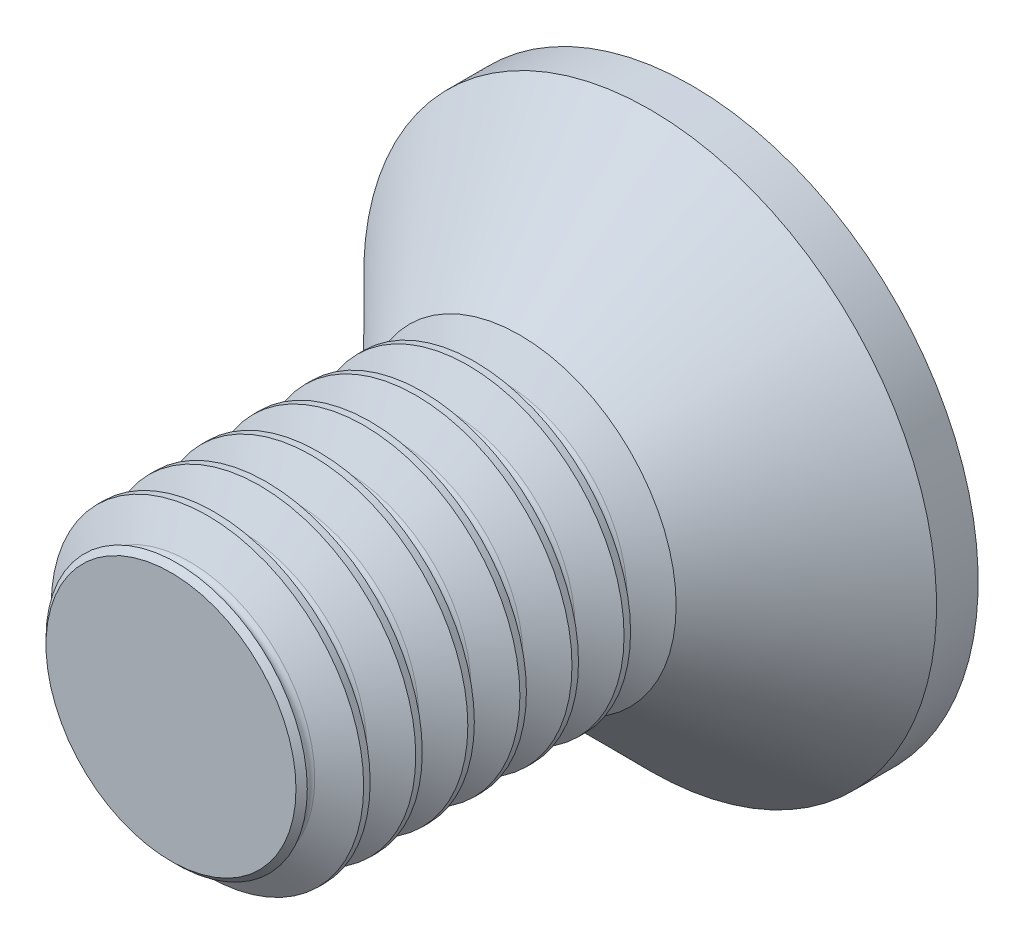
ISO-10303-21;
HEADER;
FILE_DESCRIPTION(('STEP AP214'),'2;1');
FILE_NAME('part.step','',(''),(''),'','','');
FILE_SCHEMA(('AUTOMOTIVE_DESIGN { 1 0 10303 214 1 1 1 1 }'));
ENDSEC;
DATA;
#1=APPLICATION_CONTEXT('core data for automotive mechanical design processes');
#2=APPLICATION_PROTOCOL_DEFINITION('international standard','automotive_design',2000,#1);
#3=PRODUCT_CONTEXT('',#1,'mechanical');
#4=PRODUCT('Part','Part','',(#3));
#5=PRODUCT_RELATED_PRODUCT_CATEGORY('part','',(#4));
#6=PRODUCT_DEFINITION_FORMATION('','',#4);
#7=PRODUCT_DEFINITION_CONTEXT('part definition',#1,'design');
#8=PRODUCT_DEFINITION('design','',#6,#7);
#9=PRODUCT_DEFINITION_SHAPE('','',#8);
#10=(LENGTH_UNIT() NAMED_UNIT(*) SI_UNIT(.MILLI.,.METRE.));
#11=(NAMED_UNIT(*) PLANE_ANGLE_UNIT() SI_UNIT($,.RADIAN.));
#12=(NAMED_UNIT(*) SI_UNIT($,.STERADIAN.) SOLID_ANGLE_UNIT());
#13=UNCERTAINTY_MEASURE_WITH_UNIT(LENGTH_MEASURE(1.E-05),#10,'distance_accuracy_value','');
#14=(GEOMETRIC_REPRESENTATION_CONTEXT(3) GLOBAL_UNCERTAINTY_ASSIGNED_CONTEXT((#13)) GLOBAL_UNIT_ASSIGNED_CONTEXT((#10,
#11,#12)) REPRESENTATION_CONTEXT('',''));
#15=CARTESIAN_POINT('',(0.,0.,0.));
#16=DIRECTION('',(0.,0.,1.));
#17=DIRECTION('',(1.,0.,0.));
#18=AXIS2_PLACEMENT_3D('',#15,#16,#17);
#19=CARTESIAN_POINT('',(0.,1.5,0.));
#20=DIRECTION('',(0.,0.,1.));
#21=DIRECTION('',(1.,0.,0.));
#22=AXIS2_PLACEMENT_3D('',#19,#20,#21);
#23=PLANE('',#22);
#24=CARTESIAN_POINT('',(0.,0.,0.));
#25=DIRECTION('',(0.,0.,-1.));
#26=DIRECTION('',(0.,1.,0.));
#27=AXIS2_PLACEMENT_3D('',#24,#25,#26);
#28=CIRCLE('',#27,2.75);
#29=CARTESIAN_POINT('',(0.,2.75,0.));
#30=VERTEX_POINT('',#29);
#31=EDGE_CURVE('E210',#30,#30,#28,.T.);
#32=ORIENTED_EDGE('',*,*,#31,.T.);
#33=EDGE_LOOP('',(#32));
#34=FACE_BOUND('',#33,.T.);
#35=CARTESIAN_POINT('',(0.808290376865476,1.4,0.));
#36=DIRECTION('',(0.,0.,-1.));
#37=DIRECTION('',(1.,0.,0.));
#38=AXIS2_PLACEMENT_3D('',#35,#36,#37);
#39=CIRCLE('',#38,0.642202852251812);
#40=CARTESIAN_POINT('',(0.995362839029657,0.785647985809281,0.));
#41=VERTEX_POINT('',#40);
#42=CARTESIAN_POINT('',(0.182709694628085,1.25483349748732,0.));
#43=VERTEX_POINT('',#42);
#44=EDGE_CURVE('E53',#41,#43,#39,.T.);
#45=ORIENTED_EDGE('',*,*,#44,.T.);
#46=CARTESIAN_POINT('',(0.,1.21243556529821,0.));
#47=DIRECTION('',(0.,0.,1.));
#48=DIRECTION('',(1.,0.,0.));
#49=AXIS2_PLACEMENT_3D('',#46,#47,#48);
#50=CIRCLE('',#49,0.187564434701786);
#51=CARTESIAN_POINT('',(-0.182709694628085,1.25483349748732,0.));
#52=VERTEX_POINT('',#51);
#53=EDGE_CURVE('E183',#43,#52,#50,.T.);
#54=ORIENTED_EDGE('',*,*,#53,.T.);
#55=CARTESIAN_POINT('',(-0.808290376865476,1.4,0.));
#56=DIRECTION('',(0.,0.,-1.));
#57=DIRECTION('',(1.,0.,0.));
#58=AXIS2_PLACEMENT_3D('',#55,#56,#57);
#59=CIRCLE('',#58,0.642202852251812);
#60=CARTESIAN_POINT('',(-0.995362839029657,0.785647985809281,0.));
#61=VERTEX_POINT('',#60);
#62=EDGE_CURVE('E186',#52,#61,#59,.T.);
#63=ORIENTED_EDGE('',*,*,#62,.T.);
#64=CARTESIAN_POINT('',(-1.05,0.606217782649107,0.));
#65=DIRECTION('',(0.,0.,1.));
#66=DIRECTION('',(1.,0.,0.));
#67=AXIS2_PLACEMENT_3D('',#64,#65,#66);
#68=CIRCLE('',#67,0.187564434701786);
#69=CARTESIAN_POINT('',(-1.17807253365774,0.469185511678043,0.));
#70=VERTEX_POINT('',#69);
#71=EDGE_CURVE('E189',#61,#70,#68,.T.);
#72=ORIENTED_EDGE('',*,*,#71,.T.);
#73=CARTESIAN_POINT('',(-1.61658075373095,0.,0.));
#74=DIRECTION('',(0.,0.,-1.));
#75=DIRECTION('',(1.,0.,0.));
#76=AXIS2_PLACEMENT_3D('',#73,#74,#75);
#77=CIRCLE('',#76,0.642202852251811);
#78=CARTESIAN_POINT('',(-1.17807253365774,-0.469185511678043,0.));
#79=VERTEX_POINT('',#78);
#80=EDGE_CURVE('E192',#70,#79,#77,.T.);
#81=ORIENTED_EDGE('',*,*,#80,.T.);
#82=CARTESIAN_POINT('',(-1.05,-0.606217782649107,0.));
#83=DIRECTION('',(0.,0.,1.));
#84=DIRECTION('',(1.,0.,0.));
#85=AXIS2_PLACEMENT_3D('',#82,#83,#84);
#86=CIRCLE('',#85,0.187564434701786);
#87=CARTESIAN_POINT('',(-0.995362839029657,-0.785647985809281,0.));
#88=VERTEX_POINT('',#87);
#89=EDGE_CURVE('E195',#79,#88,#86,.T.);
#90=ORIENTED_EDGE('',*,*,#89,.T.);
#91=CARTESIAN_POINT('',(-0.808290376865476,-1.4,0.));
#92=DIRECTION('',(0.,0.,-1.));
#93=DIRECTION('',(1.,0.,0.));
#94=AXIS2_PLACEMENT_3D('',#91,#92,#93);
#95=CIRCLE('',#94,0.642202852251812);
#96=CARTESIAN_POINT('',(-0.182709694628085,-1.25483349748732,0.));
#97=VERTEX_POINT('',#96);
#98=EDGE_CURVE('E198',#88,#97,#95,.T.);
#99=ORIENTED_EDGE('',*,*,#98,.T.);
#100=CARTESIAN_POINT('',(0.,-1.21243556529821,0.));
#101=DIRECTION('',(0.,0.,1.));
#102=DIRECTION('',(1.,0.,0.));
#103=AXIS2_PLACEMENT_3D('',#100,#101,#102);
#104=CIRCLE('',#103,0.187564434701786);
#105=CARTESIAN_POINT('',(0.182709694628085,-1.25483349748732,0.));
#106=VERTEX_POINT('',#105);
#107=EDGE_CURVE('E201',#97,#106,#104,.T.);
#108=ORIENTED_EDGE('',*,*,#107,.T.);
#109=CARTESIAN_POINT('',(0.808290376865476,-1.4,0.));
#110=DIRECTION('',(0.,0.,-1.));
#111=DIRECTION('',(1.,0.,0.));
#112=AXIS2_PLACEMENT_3D('',#109,#110,#111);
#113=CIRCLE('',#112,0.642202852251812);
#114=CARTESIAN_POINT('',(0.995362839029657,-0.78564798580928,0.));
#115=VERTEX_POINT('',#114);
#116=EDGE_CURVE('E204',#106,#115,#113,.T.);
#117=ORIENTED_EDGE('',*,*,#116,.T.);
#118=CARTESIAN_POINT('',(1.05,-0.606217782649106,0.));
#119=DIRECTION('',(0.,0.,1.));
#120=DIRECTION('',(1.,0.,0.));
#121=AXIS2_PLACEMENT_3D('',#118,#119,#120);
#122=CIRCLE('',#121,0.187564434701786);
#123=CARTESIAN_POINT('',(1.17807253365774,-0.469185511678042,0.));
#124=VERTEX_POINT('',#123);
#125=EDGE_CURVE('E207',#115,#124,#122,.T.);
#126=ORIENTED_EDGE('',*,*,#125,.T.);
#127=CARTESIAN_POINT('',(1.61658075373095,0.,0.));
#128=DIRECTION('',(0.,0.,-1.));
#129=DIRECTION('',(1.,0.,0.));
#130=AXIS2_PLACEMENT_3D('',#127,#128,#129);
#131=CIRCLE('',#130,0.642202852251811);
#132=CARTESIAN_POINT('',(1.17807253365774,0.469185511678043,0.));
#133=VERTEX_POINT('',#132);
#134=EDGE_CURVE('E136',#124,#133,#131,.T.);
#135=ORIENTED_EDGE('',*,*,#134,.T.);
#136=CARTESIAN_POINT('',(1.05,0.606217782649107,0.));
#137=DIRECTION('',(0.,0.,1.));
#138=DIRECTION('',(1.,0.,0.));
#139=AXIS2_PLACEMENT_3D('',#136,#137,#138);
#140=CIRCLE('',#139,0.187564434701786);
#141=EDGE_CURVE('E131',#133,#41,#140,.T.);
#142=ORIENTED_EDGE('',*,*,#141,.T.);
#143=EDGE_LOOP('',(#45,#54,#63,#72,#81,#90,#99,#108,#117,#126,#135,#142));
#144=FACE_BOUND('',#143,.T.);
#145=ADVANCED_FACE('F36',(#34,#144),#23,.F.);
#146=CARTESIAN_POINT('',(0.,0.,5.));
#147=DIRECTION('',(0.,0.,1.));
#148=DIRECTION('',(1.,0.,0.));
#149=AXIS2_PLACEMENT_3D('',#146,#147,#148);
#150=CYLINDRICAL_SURFACE('',#149,1.5);
#151=CARTESIAN_POINT('',(0.,0.,2.15));
#152=DIRECTION('',(0.,0.,1.));
#153=DIRECTION('',(1.,0.,0.));
#154=AXIS2_PLACEMENT_3D('',#151,#152,#153);
#155=CIRCLE('',#154,1.5);
#156=CARTESIAN_POINT('',(1.5,0.,2.15));
#157=VERTEX_POINT('',#156);
#158=EDGE_CURVE('E277',#157,#157,#155,.T.);
#159=ORIENTED_EDGE('',*,*,#158,.F.);
#160=EDGE_LOOP('',(#159));
#161=FACE_BOUND('',#160,.T.);
#162=CARTESIAN_POINT('',(0.,0.,2.0875));
#163=DIRECTION('',(0.,0.,1.));
#164=DIRECTION('',(1.,0.,0.));
#165=AXIS2_PLACEMENT_3D('',#162,#163,#164);
#166=CIRCLE('',#165,1.5);
#167=CARTESIAN_POINT('',(1.5,0.,2.0875));
#168=VERTEX_POINT('',#167);
#169=EDGE_CURVE('E45',#168,#168,#166,.T.);
#170=ORIENTED_EDGE('',*,*,#169,.T.);
#171=EDGE_LOOP('',(#170));
#172=FACE_BOUND('',#171,.T.);
#173=ADVANCED_FACE('F311',(#161,#172),#150,.T.);
#174=CARTESIAN_POINT('',(0.,0.,1.915625));
#175=DIRECTION('',(0.,0.,1.));
#176=DIRECTION('',(1.,0.,0.));
#177=AXIS2_PLACEMENT_3D('',#174,#175,#176);
#178=CONICAL_SURFACE('',#177,1.2023037674491,1.04719755119659);
#179=ORIENTED_EDGE('',*,*,#169,.F.);
#180=EDGE_LOOP('',(#179));
#181=FACE_BOUND('',#180,.T.);
#182=CARTESIAN_POINT('',(0.,0.,1.915625));
#183=DIRECTION('',(0.,0.,1.));
#184=DIRECTION('',(1.,0.,0.));
#185=AXIS2_PLACEMENT_3D('',#182,#183,#184);
#186=CIRCLE('',#185,1.2023037674491);
#187=CARTESIAN_POINT('',(1.2023037674491,0.,1.915625));
#188=VERTEX_POINT('',#187);
#189=EDGE_CURVE('E283',#188,#188,#186,.T.);
#190=ORIENTED_EDGE('',*,*,#189,.T.);
#191=EDGE_LOOP('',(#190));
#192=FACE_BOUND('',#191,.T.);
#193=ADVANCED_FACE('F318',(#181,#192),#178,.T.);
#194=CARTESIAN_POINT('',(0.,0.,1.65));
#195=DIRECTION('',(0.,0.,-1.));
#196=DIRECTION('',(-1.,0.,0.));
#197=AXIS2_PLACEMENT_3D('',#194,#195,#196);
#198=CONICAL_SURFACE('',#197,1.5,1.0471975511966);
#199=CARTESIAN_POINT('',(0.,0.,1.821875));
#200=DIRECTION('',(0.,0.,1.));
#201=DIRECTION('',(1.,0.,0.));
#202=AXIS2_PLACEMENT_3D('',#199,#200,#201);
#203=CIRCLE('',#202,1.2023037674491);
#204=CARTESIAN_POINT('',(1.2023037674491,0.,1.821875));
#205=VERTEX_POINT('',#204);
#206=EDGE_CURVE('E286',#205,#205,#203,.T.);
#207=ORIENTED_EDGE('',*,*,#206,.F.);
#208=EDGE_LOOP('',(#207));
#209=FACE_BOUND('',#208,.T.);
#210=CARTESIAN_POINT('',(0.,0.,1.65));
#211=DIRECTION('',(0.,0.,-1.));
#212=DIRECTION('',(0.,1.,0.));
#213=AXIS2_PLACEMENT_3D('',#210,#211,#212);
#214=CIRCLE('',#213,1.5);
#215=CARTESIAN_POINT('',(0.,1.5,1.65));
#216=VERTEX_POINT('',#215);
#217=EDGE_CURVE('E147',#216,#216,#214,.T.);
#218=ORIENTED_EDGE('',*,*,#217,.F.);
#219=EDGE_LOOP('',(#218));
#220=FACE_BOUND('',#219,.T.);
#221=ADVANCED_FACE('F332',(#209,#220),#198,.T.);
#222=CARTESIAN_POINT('',(0.,0.,1.86875));
#223=DIRECTION('',(0.,0.,1.));
#224=DIRECTION('',(1.,0.,0.));
#225=AXIS2_PLACEMENT_3D('',#222,#223,#224);
#226=TOROIDAL_SURFACE('',#225,1.22936706131736,0.0541265877365271);
#227=ORIENTED_EDGE('',*,*,#189,.F.);
#228=EDGE_LOOP('',(#227));
#229=FACE_BOUND('',#228,.T.);
#230=ORIENTED_EDGE('',*,*,#206,.T.);
#231=EDGE_LOOP('',(#230));
#232=FACE_BOUND('',#231,.T.);
#233=ADVANCED_FACE('F336',(#229,#232),#226,.F.);
#234=CARTESIAN_POINT('',(0.,0.,2.415625));
#235=DIRECTION('',(0.,0.,1.));
#236=DIRECTION('',(1.,0.,0.));
#237=AXIS2_PLACEMENT_3D('',#234,#235,#236);
#238=CONICAL_SURFACE('',#237,1.2023037674491,1.04719755119659);
#239=CARTESIAN_POINT('',(0.,0.,2.5875));
#240=DIRECTION('',(0.,0.,1.));
#241=DIRECTION('',(1.,0.,0.));
#242=AXIS2_PLACEMENT_3D('',#239,#240,#241);
#243=CIRCLE('',#242,1.5);
#244=CARTESIAN_POINT('',(1.5,0.,2.5875));
#245=VERTEX_POINT('',#244);
#246=EDGE_CURVE('E280',#245,#245,#243,.T.);
#247=ORIENTED_EDGE('',*,*,#246,.F.);
#248=EDGE_LOOP('',(#247));
#249=FACE_BOUND('',#248,.T.);
#250=CARTESIAN_POINT('',(0.,0.,2.415625));
#251=DIRECTION('',(0.,0.,1.));
#252=DIRECTION('',(1.,0.,0.));
#253=AXIS2_PLACEMENT_3D('',#250,#251,#252);
#254=CIRCLE('',#253,1.2023037674491);
#255=CARTESIAN_POINT('',(1.2023037674491,0.,2.415625));
#256=VERTEX_POINT('',#255);
#257=EDGE_CURVE('E271',#256,#256,#254,.T.);
#258=ORIENTED_EDGE('',*,*,#257,.T.);
#259=EDGE_LOOP('',(#258));
#260=FACE_BOUND('',#259,.T.);
#261=ADVANCED_FACE('F340',(#249,#260),#238,.T.);
#262=CARTESIAN_POINT('',(0.,0.,2.15));
#263=DIRECTION('',(0.,0.,-1.));
#264=DIRECTION('',(-1.,0.,0.));
#265=AXIS2_PLACEMENT_3D('',#262,#263,#264);
#266=CONICAL_SURFACE('',#265,1.5,1.0471975511966);
#267=CARTESIAN_POINT('',(0.,0.,2.321875));
#268=DIRECTION('',(0.,0.,1.));
#269=DIRECTION('',(1.,0.,0.));
#270=AXIS2_PLACEMENT_3D('',#267,#268,#269);
#271=CIRCLE('',#270,1.2023037674491);
#272=CARTESIAN_POINT('',(1.2023037674491,0.,2.321875));
#273=VERTEX_POINT('',#272);
#274=EDGE_CURVE('E274',#273,#273,#271,.T.);
#275=ORIENTED_EDGE('',*,*,#274,.F.);
#276=EDGE_LOOP('',(#275));
#277=FACE_BOUND('',#276,.T.);
#278=ORIENTED_EDGE('',*,*,#158,.T.);
#279=EDGE_LOOP('',(#278));
#280=FACE_BOUND('',#279,.T.);
#281=ADVANCED_FACE('F344',(#277,#280),#266,.T.);
#282=CARTESIAN_POINT('',(0.,0.,2.36875));
#283=DIRECTION('',(0.,0.,1.));
#284=DIRECTION('',(1.,0.,0.));
#285=AXIS2_PLACEMENT_3D('',#282,#283,#284);
#286=TOROIDAL_SURFACE('',#285,1.22936706131736,0.0541265877365271);
#287=ORIENTED_EDGE('',*,*,#257,.F.);
#288=EDGE_LOOP('',(#287));
#289=FACE_BOUND('',#288,.T.);
#290=ORIENTED_EDGE('',*,*,#274,.T.);
#291=EDGE_LOOP('',(#290));
#292=FACE_BOUND('',#291,.T.);
#293=ADVANCED_FACE('F348',(#289,#292),#286,.F.);
#294=CARTESIAN_POINT('',(0.,0.,2.65));
#295=DIRECTION('',(0.,0.,1.));
#296=DIRECTION('',(1.,0.,0.));
#297=AXIS2_PLACEMENT_3D('',#294,#295,#296);
#298=CIRCLE('',#297,1.5);
#299=CARTESIAN_POINT('',(1.5,0.,2.65));
#300=VERTEX_POINT('',#299);
#301=EDGE_CURVE('E265',#300,#300,#298,.T.);
#302=ORIENTED_EDGE('',*,*,#301,.F.);
#303=EDGE_LOOP('',(#302));
#304=FACE_BOUND('',#303,.T.);
#305=ORIENTED_EDGE('',*,*,#246,.T.);
#306=EDGE_LOOP('',(#305));
#307=FACE_BOUND('',#306,.T.);
#308=ADVANCED_FACE('F320',(#304,#307),#150,.T.);
#309=CARTESIAN_POINT('',(0.,0.,2.915625));
#310=DIRECTION('',(0.,0.,1.));
#311=DIRECTION('',(1.,0.,0.));
#312=AXIS2_PLACEMENT_3D('',#309,#310,#311);
#313=CONICAL_SURFACE('',#312,1.2023037674491,1.04719755119659);
#314=CARTESIAN_POINT('',(0.,0.,3.0875));
#315=DIRECTION('',(0.,0.,1.));
#316=DIRECTION('',(1.,0.,0.));
#317=AXIS2_PLACEMENT_3D('',#314,#315,#316);
#318=CIRCLE('',#317,1.5);
#319=CARTESIAN_POINT('',(1.5,0.,3.0875));
#320=VERTEX_POINT('',#319);
#321=EDGE_CURVE('E268',#320,#320,#318,.T.);
#322=ORIENTED_EDGE('',*,*,#321,.F.);
#323=EDGE_LOOP('',(#322));
#324=FACE_BOUND('',#323,.T.);
#325=CARTESIAN_POINT('',(0.,0.,2.915625));
#326=DIRECTION('',(0.,0.,1.));
#327=DIRECTION('',(1.,0.,0.));
#328=AXIS2_PLACEMENT_3D('',#325,#326,#327);
#329=CIRCLE('',#328,1.2023037674491);
#330=CARTESIAN_POINT('',(1.2023037674491,0.,2.915625));
#331=VERTEX_POINT('',#330);
#332=EDGE_CURVE('E259',#331,#331,#329,.T.);
#333=ORIENTED_EDGE('',*,*,#332,.T.);
#334=EDGE_LOOP('',(#333));
#335=FACE_BOUND('',#334,.T.);
#336=ADVANCED_FACE('F353',(#324,#335),#313,.T.);
#337=CARTESIAN_POINT('',(0.,0.,2.65));
#338=DIRECTION('',(0.,0.,-1.));
#339=DIRECTION('',(-1.,0.,0.));
#340=AXIS2_PLACEMENT_3D('',#337,#338,#339);
#341=CONICAL_SURFACE('',#340,1.5,1.0471975511966);
#342=CARTESIAN_POINT('',(0.,0.,2.821875));
#343=DIRECTION('',(0.,0.,1.));
#344=DIRECTION('',(1.,0.,0.));
#345=AXIS2_PLACEMENT_3D('',#342,#343,#344);
#346=CIRCLE('',#345,1.2023037674491);
#347=CARTESIAN_POINT('',(1.2023037674491,0.,2.821875));
#348=VERTEX_POINT('',#347);
#349=EDGE_CURVE('E262',#348,#348,#346,.T.);
#350=ORIENTED_EDGE('',*,*,#349,.F.);
#351=EDGE_LOOP('',(#350));
#352=FACE_BOUND('',#351,.T.);
#353=ORIENTED_EDGE('',*,*,#301,.T.);
#354=EDGE_LOOP('',(#353));
#355=FACE_BOUND('',#354,.T.);
#356=ADVANCED_FACE('F356',(#352,#355),#341,.T.);
#357=CARTESIAN_POINT('',(0.,0.,2.86875));
#358=DIRECTION('',(0.,0.,1.));
#359=DIRECTION('',(1.,0.,0.));
#360=AXIS2_PLACEMENT_3D('',#357,#358,#359);
#361=TOROIDAL_SURFACE('',#360,1.22936706131736,0.0541265877365271);
#362=ORIENTED_EDGE('',*,*,#332,.F.);
#363=EDGE_LOOP('',(#362));
#364=FACE_BOUND('',#363,.T.);
#365=ORIENTED_EDGE('',*,*,#349,.T.);
#366=EDGE_LOOP('',(#365));
#367=FACE_BOUND('',#366,.T.);
#368=ADVANCED_FACE('F360',(#364,#367),#361,.F.);
#369=CARTESIAN_POINT('',(0.,0.,3.15));
#370=DIRECTION('',(0.,0.,1.));
#371=DIRECTION('',(1.,0.,0.));
#372=AXIS2_PLACEMENT_3D('',#369,#370,#371);
#373=CIRCLE('',#372,1.5);
#374=CARTESIAN_POINT('',(1.5,0.,3.15));
#375=VERTEX_POINT('',#374);
#376=EDGE_CURVE('E253',#375,#375,#373,.T.);
#377=ORIENTED_EDGE('',*,*,#376,.F.);
#378=EDGE_LOOP('',(#377));
#379=FACE_BOUND('',#378,.T.);
#380=ORIENTED_EDGE('',*,*,#321,.T.);
#381=EDGE_LOOP('',(#380));
#382=FACE_BOUND('',#381,.T.);
#383=ADVANCED_FACE('F364',(#379,#382),#150,.T.);
#384=CARTESIAN_POINT('',(0.,0.,3.415625));
#385=DIRECTION('',(0.,0.,1.));
#386=DIRECTION('',(1.,0.,0.));
#387=AXIS2_PLACEMENT_3D('',#384,#385,#386);
#388=CONICAL_SURFACE('',#387,1.2023037674491,1.04719755119659);
#389=CARTESIAN_POINT('',(0.,0.,3.5875));
#390=DIRECTION('',(0.,0.,1.));
#391=DIRECTION('',(1.,0.,0.));
#392=AXIS2_PLACEMENT_3D('',#389,#390,#391);
#393=CIRCLE('',#392,1.5);
#394=CARTESIAN_POINT('',(1.5,0.,3.5875));
#395=VERTEX_POINT('',#394);
#396=EDGE_CURVE('E256',#395,#395,#393,.T.);
#397=ORIENTED_EDGE('',*,*,#396,.F.);
#398=EDGE_LOOP('',(#397));
#399=FACE_BOUND('',#398,.T.);
#400=CARTESIAN_POINT('',(0.,0.,3.415625));
#401=DIRECTION('',(0.,0.,1.));
#402=DIRECTION('',(1.,0.,0.));
#403=AXIS2_PLACEMENT_3D('',#400,#401,#402);
#404=CIRCLE('',#403,1.2023037674491);
#405=CARTESIAN_POINT('',(1.2023037674491,0.,3.415625));
#406=VERTEX_POINT('',#405);
#407=EDGE_CURVE('E247',#406,#406,#404,.T.);
#408=ORIENTED_EDGE('',*,*,#407,.T.);
#409=EDGE_LOOP('',(#408));
#410=FACE_BOUND('',#409,.T.);
#411=ADVANCED_FACE('F366',(#399,#410),#388,.T.);
#412=CARTESIAN_POINT('',(0.,0.,3.15));
#413=DIRECTION('',(0.,0.,-1.));
#414=DIRECTION('',(-1.,0.,0.));
#415=AXIS2_PLACEMENT_3D('',#412,#413,#414);
#416=CONICAL_SURFACE('',#415,1.5,1.0471975511966);
#417=CARTESIAN_POINT('',(0.,0.,3.321875));
#418=DIRECTION('',(0.,0.,1.));
#419=DIRECTION('',(1.,0.,0.));
#420=AXIS2_PLACEMENT_3D('',#417,#418,#419);
#421=CIRCLE('',#420,1.2023037674491);
#422=CARTESIAN_POINT('',(1.2023037674491,0.,3.321875));
#423=VERTEX_POINT('',#422);
#424=EDGE_CURVE('E250',#423,#423,#421,.T.);
#425=ORIENTED_EDGE('',*,*,#424,.F.);
#426=EDGE_LOOP('',(#425));
#427=FACE_BOUND('',#426,.T.);
#428=ORIENTED_EDGE('',*,*,#376,.T.);
#429=EDGE_LOOP('',(#428));
#430=FACE_BOUND('',#429,.T.);
#431=ADVANCED_FACE('F369',(#427,#430),#416,.T.);
#432=CARTESIAN_POINT('',(0.,0.,3.36875));
#433=DIRECTION('',(0.,0.,1.));
#434=DIRECTION('',(1.,0.,0.));
#435=AXIS2_PLACEMENT_3D('',#432,#433,#434);
#436=TOROIDAL_SURFACE('',#435,1.22936706131736,0.0541265877365271);
#437=ORIENTED_EDGE('',*,*,#407,.F.);
#438=EDGE_LOOP('',(#437));
#439=FACE_BOUND('',#438,.T.);
#440=ORIENTED_EDGE('',*,*,#424,.T.);
#441=EDGE_LOOP('',(#440));
#442=FACE_BOUND('',#441,.T.);
#443=ADVANCED_FACE('F373',(#439,#442),#436,.F.);
#444=CARTESIAN_POINT('',(0.,0.,3.65));
#445=DIRECTION('',(0.,0.,1.));
#446=DIRECTION('',(1.,0.,0.));
#447=AXIS2_PLACEMENT_3D('',#444,#445,#446);
#448=CIRCLE('',#447,1.5);
#449=CARTESIAN_POINT('',(1.5,0.,3.65));
#450=VERTEX_POINT('',#449);
#451=EDGE_CURVE('E241',#450,#450,#448,.T.);
#452=ORIENTED_EDGE('',*,*,#451,.F.);
#453=EDGE_LOOP('',(#452));
#454=FACE_BOUND('',#453,.T.);
#455=ORIENTED_EDGE('',*,*,#396,.T.);
#456=EDGE_LOOP('',(#455));
#457=FACE_BOUND('',#456,.T.);
#458=ADVANCED_FACE('F377',(#454,#457),#150,.T.);
#459=CARTESIAN_POINT('',(0.,0.,3.915625));
#460=DIRECTION('',(0.,0.,1.));
#461=DIRECTION('',(1.,0.,0.));
#462=AXIS2_PLACEMENT_3D('',#459,#460,#461);
#463=CONICAL_SURFACE('',#462,1.2023037674491,1.04719755119659);
#464=CARTESIAN_POINT('',(0.,0.,4.0875));
#465=DIRECTION('',(0.,0.,1.));
#466=DIRECTION('',(1.,0.,0.));
#467=AXIS2_PLACEMENT_3D('',#464,#465,#466);
#468=CIRCLE('',#467,1.5);
#469=CARTESIAN_POINT('',(1.5,0.,4.0875));
#470=VERTEX_POINT('',#469);
#471=EDGE_CURVE('E244',#470,#470,#468,.T.);
#472=ORIENTED_EDGE('',*,*,#471,.F.);
#473=EDGE_LOOP('',(#472));
#474=FACE_BOUND('',#473,.T.);
#475=CARTESIAN_POINT('',(0.,0.,3.915625));
#476=DIRECTION('',(0.,0.,1.));
#477=DIRECTION('',(1.,0.,0.));
#478=AXIS2_PLACEMENT_3D('',#475,#476,#477);
#479=CIRCLE('',#478,1.2023037674491);
#480=CARTESIAN_POINT('',(1.2023037674491,0.,3.915625));
#481=VERTEX_POINT('',#480);
#482=EDGE_CURVE('E235',#481,#481,#479,.T.);
#483=ORIENTED_EDGE('',*,*,#482,.T.);
#484=EDGE_LOOP('',(#483));
#485=FACE_BOUND('',#484,.T.);
#486=ADVANCED_FACE('F379',(#474,#485),#463,.T.);
#487=CARTESIAN_POINT('',(0.,0.,3.65));
#488=DIRECTION('',(0.,0.,-1.));
#489=DIRECTION('',(-1.,0.,0.));
#490=AXIS2_PLACEMENT_3D('',#487,#488,#489);
#491=CONICAL_SURFACE('',#490,1.5,1.0471975511966);
#492=CARTESIAN_POINT('',(0.,0.,3.821875));
#493=DIRECTION('',(0.,0.,1.));
#494=DIRECTION('',(1.,0.,0.));
#495=AXIS2_PLACEMENT_3D('',#492,#493,#494);
#496=CIRCLE('',#495,1.2023037674491);
#497=CARTESIAN_POINT('',(1.2023037674491,0.,3.821875));
#498=VERTEX_POINT('',#497);
#499=EDGE_CURVE('E238',#498,#498,#496,.T.);
#500=ORIENTED_EDGE('',*,*,#499,.F.);
#501=EDGE_LOOP('',(#500));
#502=FACE_BOUND('',#501,.T.);
#503=ORIENTED_EDGE('',*,*,#451,.T.);
#504=EDGE_LOOP('',(#503));
#505=FACE_BOUND('',#504,.T.);
#506=ADVANCED_FACE('F382',(#502,#505),#491,.T.);
#507=CARTESIAN_POINT('',(0.,0.,3.86875));
#508=DIRECTION('',(0.,0.,1.));
#509=DIRECTION('',(1.,0.,0.));
#510=AXIS2_PLACEMENT_3D('',#507,#508,#509);
#511=TOROIDAL_SURFACE('',#510,1.22936706131736,0.0541265877365271);
#512=ORIENTED_EDGE('',*,*,#482,.F.);
#513=EDGE_LOOP('',(#512));
#514=FACE_BOUND('',#513,.T.);
#515=ORIENTED_EDGE('',*,*,#499,.T.);
#516=EDGE_LOOP('',(#515));
#517=FACE_BOUND('',#516,.T.);
#518=ADVANCED_FACE('F386',(#514,#517),#511,.F.);
#519=CARTESIAN_POINT('',(0.,0.,4.15));
#520=DIRECTION('',(0.,0.,1.));
#521=DIRECTION('',(1.,0.,0.));
#522=AXIS2_PLACEMENT_3D('',#519,#520,#521);
#523=CIRCLE('',#522,1.5);
#524=CARTESIAN_POINT('',(1.5,0.,4.15));
#525=VERTEX_POINT('',#524);
#526=EDGE_CURVE('E229',#525,#525,#523,.T.);
#527=ORIENTED_EDGE('',*,*,#526,.F.);
#528=EDGE_LOOP('',(#527));
#529=FACE_BOUND('',#528,.T.);
#530=ORIENTED_EDGE('',*,*,#471,.T.);
#531=EDGE_LOOP('',(#530));
#532=FACE_BOUND('',#531,.T.);
#533=ADVANCED_FACE('F310',(#529,#532),#150,.T.);
#534=CARTESIAN_POINT('',(0.,0.,4.415625));
#535=DIRECTION('',(0.,0.,1.));
#536=DIRECTION('',(1.,0.,0.));
#537=AXIS2_PLACEMENT_3D('',#534,#535,#536);
#538=CONICAL_SURFACE('',#537,1.2023037674491,1.04719755119659);
#539=CARTESIAN_POINT('',(0.,0.,4.5875));
#540=DIRECTION('',(0.,0.,1.));
#541=DIRECTION('',(1.,0.,0.));
#542=AXIS2_PLACEMENT_3D('',#539,#540,#541);
#543=CIRCLE('',#542,1.5);
#544=CARTESIAN_POINT('',(1.5,0.,4.5875));
#545=VERTEX_POINT('',#544);
#546=EDGE_CURVE('E232',#545,#545,#543,.T.);
#547=ORIENTED_EDGE('',*,*,#546,.F.);
#548=EDGE_LOOP('',(#547));
#549=FACE_BOUND('',#548,.T.);
#550=CARTESIAN_POINT('',(0.,0.,4.415625));
#551=DIRECTION('',(0.,0.,1.));
#552=DIRECTION('',(1.,0.,0.));
#553=AXIS2_PLACEMENT_3D('',#550,#551,#552);
#554=CIRCLE('',#553,1.2023037674491);
#555=CARTESIAN_POINT('',(1.2023037674491,0.,4.415625));
#556=VERTEX_POINT('',#555);
#557=EDGE_CURVE('E223',#556,#556,#554,.T.);
#558=ORIENTED_EDGE('',*,*,#557,.T.);
#559=EDGE_LOOP('',(#558));
#560=FACE_BOUND('',#559,.T.);
#561=ADVANCED_FACE('F391',(#549,#560),#538,.T.);
#562=CARTESIAN_POINT('',(0.,0.,4.15));
#563=DIRECTION('',(0.,0.,-1.));
#564=DIRECTION('',(-1.,0.,0.));
#565=AXIS2_PLACEMENT_3D('',#562,#563,#564);
#566=CONICAL_SURFACE('',#565,1.5,1.0471975511966);
#567=CARTESIAN_POINT('',(0.,0.,4.321875));
#568=DIRECTION('',(0.,0.,1.));
#569=DIRECTION('',(1.,0.,0.));
#570=AXIS2_PLACEMENT_3D('',#567,#568,#569);
#571=CIRCLE('',#570,1.2023037674491);
#572=CARTESIAN_POINT('',(1.2023037674491,0.,4.321875));
#573=VERTEX_POINT('',#572);
#574=EDGE_CURVE('E226',#573,#573,#571,.T.);
#575=ORIENTED_EDGE('',*,*,#574,.F.);
#576=EDGE_LOOP('',(#575));
#577=FACE_BOUND('',#576,.T.);
#578=ORIENTED_EDGE('',*,*,#526,.T.);
#579=EDGE_LOOP('',(#578));
#580=FACE_BOUND('',#579,.T.);
#581=ADVANCED_FACE('F394',(#577,#580),#566,.T.);
#582=CARTESIAN_POINT('',(0.,0.,4.36875));
#583=DIRECTION('',(0.,0.,1.));
#584=DIRECTION('',(1.,0.,0.));
#585=AXIS2_PLACEMENT_3D('',#582,#583,#584);
#586=TOROIDAL_SURFACE('',#585,1.22936706131736,0.0541265877365271);
#587=ORIENTED_EDGE('',*,*,#557,.F.);
#588=EDGE_LOOP('',(#587));
#589=FACE_BOUND('',#588,.T.);
#590=ORIENTED_EDGE('',*,*,#574,.T.);
#591=EDGE_LOOP('',(#590));
#592=FACE_BOUND('',#591,.T.);
#593=ADVANCED_FACE('F308',(#589,#592),#586,.F.);
#594=CARTESIAN_POINT('',(0.,0.,4.65));
#595=DIRECTION('',(0.,0.,1.));
#596=DIRECTION('',(1.,0.,0.));
#597=AXIS2_PLACEMENT_3D('',#594,#595,#596);
#598=CIRCLE('',#597,1.5);
#599=CARTESIAN_POINT('',(1.5,0.,4.65));
#600=VERTEX_POINT('',#599);
#601=EDGE_CURVE('E219',#600,#600,#598,.T.);
#602=ORIENTED_EDGE('',*,*,#601,.F.);
#603=EDGE_LOOP('',(#602));
#604=FACE_BOUND('',#603,.T.);
#605=ORIENTED_EDGE('',*,*,#546,.T.);
#606=EDGE_LOOP('',(#605));
#607=FACE_BOUND('',#606,.T.);
#608=ADVANCED_FACE('F38',(#604,#607),#150,.T.);
#609=CARTESIAN_POINT('',(0.,0.,4.915625));
#610=DIRECTION('',(0.,0.,1.));
#611=DIRECTION('',(1.,0.,0.));
#612=AXIS2_PLACEMENT_3D('',#609,#610,#611);
#613=CONICAL_SURFACE('',#612,1.2023037674491,1.04719755119659);
#614=CARTESIAN_POINT('',(0.,0.,4.915625));
#615=DIRECTION('',(0.,0.,1.));
#616=DIRECTION('',(1.,0.,0.));
#617=AXIS2_PLACEMENT_3D('',#614,#615,#616);
#618=CIRCLE('',#617,1.2023037674491);
#619=CARTESIAN_POINT('',(1.2023037674491,0.,4.915625));
#620=VERTEX_POINT('',#619);
#621=EDGE_CURVE('E213',#620,#620,#618,.T.);
#622=ORIENTED_EDGE('',*,*,#621,.T.);
#623=EDGE_LOOP('',(#622));
#624=FACE_BOUND('',#623,.T.);
#625=CARTESIAN_POINT('',(0.,0.,4.94566515603353));
#626=DIRECTION('',(0.,0.,1.));
#627=DIRECTION('',(1.,0.,0.));
#628=AXIS2_PLACEMENT_3D('',#625,#626,#627);
#629=CIRCLE('',#628,1.25433484396647);
#630=CARTESIAN_POINT('',(1.25433484396647,0.,4.94566515603353));
#631=VERTEX_POINT('',#630);
#632=EDGE_CURVE('E222',#631,#631,#629,.T.);
#633=ORIENTED_EDGE('',*,*,#632,.F.);
#634=EDGE_LOOP('',(#633));
#635=FACE_BOUND('',#634,.T.);
#636=ADVANCED_FACE('F296',(#624,#635),#613,.T.);
#637=CARTESIAN_POINT('',(0.,0.,4.65));
#638=DIRECTION('',(0.,0.,-1.));
#639=DIRECTION('',(-1.,0.,0.));
#640=AXIS2_PLACEMENT_3D('',#637,#638,#639);
#641=CONICAL_SURFACE('',#640,1.5,1.0471975511966);
#642=CARTESIAN_POINT('',(0.,0.,4.821875));
#643=DIRECTION('',(0.,0.,1.));
#644=DIRECTION('',(1.,0.,0.));
#645=AXIS2_PLACEMENT_3D('',#642,#643,#644);
#646=CIRCLE('',#645,1.2023037674491);
#647=CARTESIAN_POINT('',(1.2023037674491,0.,4.821875));
#648=VERTEX_POINT('',#647);
#649=EDGE_CURVE('E216',#648,#648,#646,.T.);
#650=ORIENTED_EDGE('',*,*,#649,.F.);
#651=EDGE_LOOP('',(#650));
#652=FACE_BOUND('',#651,.T.);
#653=ORIENTED_EDGE('',*,*,#601,.T.);
#654=EDGE_LOOP('',(#653));
#655=FACE_BOUND('',#654,.T.);
#656=ADVANCED_FACE('F298',(#652,#655),#641,.T.);
#657=CARTESIAN_POINT('',(0.,0.,4.86875));
#658=DIRECTION('',(0.,0.,1.));
#659=DIRECTION('',(1.,0.,0.));
#660=AXIS2_PLACEMENT_3D('',#657,#658,#659);
#661=TOROIDAL_SURFACE('',#660,1.22936706131736,0.0541265877365271);
#662=ORIENTED_EDGE('',*,*,#621,.F.);
#663=EDGE_LOOP('',(#662));
#664=FACE_BOUND('',#663,.T.);
#665=ORIENTED_EDGE('',*,*,#649,.T.);
#666=EDGE_LOOP('',(#665));
#667=FACE_BOUND('',#666,.T.);
#668=ADVANCED_FACE('F305',(#664,#667),#661,.F.);
#669=CARTESIAN_POINT('',(0.,1.5,5.));
#670=DIRECTION('',(0.,0.,-1.));
#671=DIRECTION('',(-1.,0.,0.));
#672=AXIS2_PLACEMENT_3D('',#669,#670,#671);
#673=PLANE('',#672);
#674=CARTESIAN_POINT('',(0.,0.,5.));
#675=DIRECTION('',(0.,0.,1.));
#676=DIRECTION('',(1.,0.,0.));
#677=AXIS2_PLACEMENT_3D('',#674,#675,#676);
#678=CIRCLE('',#677,1.2);
#679=CARTESIAN_POINT('',(1.2,0.,5.));
#680=VERTEX_POINT('',#679);
#681=EDGE_CURVE('E11',#680,#680,#678,.T.);
#682=ORIENTED_EDGE('',*,*,#681,.T.);
#683=EDGE_LOOP('',(#682));
#684=FACE_BOUND('',#683,.T.);
#685=ADVANCED_FACE('F323',(#684),#673,.F.);
#686=CARTESIAN_POINT('',(0.,0.,4.7));
#687=DIRECTION('',(0.,0.,-1.));
#688=DIRECTION('',(-1.,0.,0.));
#689=AXIS2_PLACEMENT_3D('',#686,#687,#688);
#690=CONICAL_SURFACE('',#689,1.5,0.785398163397443);
#691=ORIENTED_EDGE('',*,*,#632,.T.);
#692=EDGE_LOOP('',(#691));
#693=FACE_BOUND('',#692,.T.);
#694=ORIENTED_EDGE('',*,*,#681,.F.);
#695=EDGE_LOOP('',(#694));
#696=FACE_BOUND('',#695,.T.);
#697=ADVANCED_FACE('F293',(#693,#696),#690,.T.);
#698=CARTESIAN_POINT('',(0.,0.,0.));
#699=DIRECTION('',(0.,0.,-1.));
#700=DIRECTION('',(0.,1.,0.));
#701=AXIS2_PLACEMENT_3D('',#698,#699,#700);
#702=CONICAL_SURFACE('',#701,3.14999999999998,0.785398163397442);
#703=ORIENTED_EDGE('',*,*,#217,.T.);
#704=EDGE_LOOP('',(#703));
#705=FACE_BOUND('',#704,.T.);
#706=CARTESIAN_POINT('',(0.,0.,0.399999999999984));
#707=DIRECTION('',(0.,0.,-1.));
#708=DIRECTION('',(0.,1.,0.));
#709=AXIS2_PLACEMENT_3D('',#706,#707,#708);
#710=CIRCLE('',#709,2.75);
#711=CARTESIAN_POINT('',(0.,2.75,0.399999999999982));
#712=VERTEX_POINT('',#711);
#713=EDGE_CURVE('E40',#712,#712,#710,.F.);
#714=ORIENTED_EDGE('',*,*,#713,.T.);
#715=EDGE_LOOP('',(#714));
#716=FACE_BOUND('',#715,.T.);
#717=ADVANCED_FACE('F329',(#705,#716),#702,.T.);
#718=CARTESIAN_POINT('',(0.,0.,0.));
#719=DIRECTION('',(0.,0.,-1.));
#720=DIRECTION('',(0.,1.,0.));
#721=AXIS2_PLACEMENT_3D('',#718,#719,#720);
#722=CYLINDRICAL_SURFACE('',#721,2.75);
#723=ORIENTED_EDGE('',*,*,#31,.F.);
#724=EDGE_LOOP('',(#723));
#725=FACE_BOUND('',#724,.T.);
#726=ORIENTED_EDGE('',*,*,#713,.F.);
#727=EDGE_LOOP('',(#726));
#728=FACE_BOUND('',#727,.T.);
#729=ADVANCED_FACE('F458',(#725,#728),#722,.T.);
#730=CARTESIAN_POINT('',(0.808290376865476,1.4,4.56214636054771));
#731=DIRECTION('',(0.,0.,-1.));
#732=DIRECTION('',(-1.,0.,0.));
#733=AXIS2_PLACEMENT_3D('',#730,#731,#732);
#734=CYLINDRICAL_SURFACE('',#733,0.642202852251812);
#735=CARTESIAN_POINT('',(0.808290376865476,1.4,0.825));
#736=DIRECTION('',(0.,0.,1.));
#737=DIRECTION('',(1.,0.,0.));
#738=AXIS2_PLACEMENT_3D('',#735,#736,#737);
#739=CIRCLE('',#738,0.642202852251812);
#740=CARTESIAN_POINT('',(0.995362839029657,0.785647985809281,0.825));
#741=VERTEX_POINT('',#740);
#742=CARTESIAN_POINT('',(0.182709694628085,1.25483349748732,0.825));
#743=VERTEX_POINT('',#742);
#744=EDGE_CURVE('E142',#741,#743,#739,.F.);
#745=ORIENTED_EDGE('',*,*,#744,.T.);
#746=DIRECTION('',(0.,0.,-1.));
#747=VECTOR('',#746,1.);
#748=CARTESIAN_POINT('',(0.182709694628085,1.25483349748732,4.56214636054771));
#749=LINE('',#748,#747);
#750=EDGE_CURVE('E181',#743,#43,#749,.T.);
#751=ORIENTED_EDGE('',*,*,#750,.T.);
#752=ORIENTED_EDGE('',*,*,#44,.F.);
#753=DIRECTION('',(0.,0.,-1.));
#754=VECTOR('',#753,1.);
#755=CARTESIAN_POINT('',(0.995362839029657,0.785647985809281,4.56214636054771));
#756=LINE('',#755,#754);
#757=EDGE_CURVE('E57',#741,#41,#756,.T.);
#758=ORIENTED_EDGE('',*,*,#757,.F.);
#759=EDGE_LOOP('',(#745,#751,#752,#758));
#760=FACE_BOUND('',#759,.T.);
#761=ADVANCED_FACE('F464',(#760),#734,.T.);
#762=CARTESIAN_POINT('',(0.,1.21243556529821,4.56214636054771));
#763=DIRECTION('',(0.,0.,-1.));
#764=DIRECTION('',(-1.,0.,0.));
#765=AXIS2_PLACEMENT_3D('',#762,#763,#764);
#766=CYLINDRICAL_SURFACE('',#765,0.187564434701786);
#767=CARTESIAN_POINT('',(0.,1.21243556529821,0.825));
#768=DIRECTION('',(0.,0.,1.));
#769=DIRECTION('',(1.,0.,0.));
#770=AXIS2_PLACEMENT_3D('',#767,#768,#769);
#771=CIRCLE('',#770,0.187564434701786);
#772=CARTESIAN_POINT('',(-0.182709694628085,1.25483349748732,0.825));
#773=VERTEX_POINT('',#772);
#774=EDGE_CURVE('E177',#743,#773,#771,.T.);
#775=ORIENTED_EDGE('',*,*,#774,.T.);
#776=DIRECTION('',(0.,0.,-1.));
#777=VECTOR('',#776,1.);
#778=CARTESIAN_POINT('',(-0.182709694628085,1.25483349748732,4.56214636054771));
#779=LINE('',#778,#777);
#780=EDGE_CURVE('E184',#773,#52,#779,.T.);
#781=ORIENTED_EDGE('',*,*,#780,.T.);
#782=ORIENTED_EDGE('',*,*,#53,.F.);
#783=ORIENTED_EDGE('',*,*,#750,.F.);
#784=EDGE_LOOP('',(#775,#781,#782,#783));
#785=FACE_BOUND('',#784,.T.);
#786=ADVANCED_FACE('F470',(#785),#766,.F.);
#787=CARTESIAN_POINT('',(-0.808290376865476,1.4,4.56214636054771));
#788=DIRECTION('',(0.,0.,-1.));
#789=DIRECTION('',(-1.,0.,0.));
#790=AXIS2_PLACEMENT_3D('',#787,#788,#789);
#791=CYLINDRICAL_SURFACE('',#790,0.642202852251812);
#792=CARTESIAN_POINT('',(-0.808290376865476,1.4,0.825));
#793=DIRECTION('',(0.,0.,1.));
#794=DIRECTION('',(1.,0.,0.));
#795=AXIS2_PLACEMENT_3D('',#792,#793,#794);
#796=CIRCLE('',#795,0.642202852251812);
#797=CARTESIAN_POINT('',(-0.995362839029657,0.785647985809281,0.825));
#798=VERTEX_POINT('',#797);
#799=EDGE_CURVE('E174',#773,#798,#796,.F.);
#800=ORIENTED_EDGE('',*,*,#799,.T.);
#801=DIRECTION('',(0.,0.,-1.));
#802=VECTOR('',#801,1.);
#803=CARTESIAN_POINT('',(-0.995362839029657,0.785647985809281,4.56214636054771));
#804=LINE('',#803,#802);
#805=EDGE_CURVE('E187',#798,#61,#804,.T.);
#806=ORIENTED_EDGE('',*,*,#805,.T.);
#807=ORIENTED_EDGE('',*,*,#62,.F.);
#808=ORIENTED_EDGE('',*,*,#780,.F.);
#809=EDGE_LOOP('',(#800,#806,#807,#808));
#810=FACE_BOUND('',#809,.T.);
#811=ADVANCED_FACE('F526',(#810),#791,.T.);
#812=CARTESIAN_POINT('',(-1.05,0.606217782649107,4.56214636054771));
#813=DIRECTION('',(0.,0.,-1.));
#814=DIRECTION('',(-1.,0.,0.));
#815=AXIS2_PLACEMENT_3D('',#812,#813,#814);
#816=CYLINDRICAL_SURFACE('',#815,0.187564434701786);
#817=CARTESIAN_POINT('',(-1.05,0.606217782649107,0.825));
#818=DIRECTION('',(0.,0.,1.));
#819=DIRECTION('',(1.,0.,0.));
#820=AXIS2_PLACEMENT_3D('',#817,#818,#819);
#821=CIRCLE('',#820,0.187564434701786);
#822=CARTESIAN_POINT('',(-1.17807253365774,0.469185511678043,0.825));
#823=VERTEX_POINT('',#822);
#824=EDGE_CURVE('E171',#798,#823,#821,.T.);
#825=ORIENTED_EDGE('',*,*,#824,.T.);
#826=DIRECTION('',(0.,0.,-1.));
#827=VECTOR('',#826,1.);
#828=CARTESIAN_POINT('',(-1.17807253365774,0.469185511678043,4.56214636054771));
#829=LINE('',#828,#827);
#830=EDGE_CURVE('E190',#823,#70,#829,.T.);
#831=ORIENTED_EDGE('',*,*,#830,.T.);
#832=ORIENTED_EDGE('',*,*,#71,.F.);
#833=ORIENTED_EDGE('',*,*,#805,.F.);
#834=EDGE_LOOP('',(#825,#831,#832,#833));
#835=FACE_BOUND('',#834,.T.);
#836=ADVANCED_FACE('F536',(#835),#816,.F.);
#837=CARTESIAN_POINT('',(-1.61658075373095,0.,4.56214636054771));
#838=DIRECTION('',(0.,0.,-1.));
#839=DIRECTION('',(-1.,0.,0.));
#840=AXIS2_PLACEMENT_3D('',#837,#838,#839);
#841=CYLINDRICAL_SURFACE('',#840,0.642202852251811);
#842=CARTESIAN_POINT('',(-1.61658075373095,0.,0.825));
#843=DIRECTION('',(0.,0.,1.));
#844=DIRECTION('',(1.,0.,0.));
#845=AXIS2_PLACEMENT_3D('',#842,#843,#844);
#846=CIRCLE('',#845,0.642202852251811);
#847=CARTESIAN_POINT('',(-1.17807253365774,-0.469185511678043,0.825));
#848=VERTEX_POINT('',#847);
#849=EDGE_CURVE('E168',#823,#848,#846,.F.);
#850=ORIENTED_EDGE('',*,*,#849,.T.);
#851=DIRECTION('',(0.,0.,-1.));
#852=VECTOR('',#851,1.);
#853=CARTESIAN_POINT('',(-1.17807253365774,-0.469185511678043,4.56214636054771));
#854=LINE('',#853,#852);
#855=EDGE_CURVE('E193',#848,#79,#854,.T.);
#856=ORIENTED_EDGE('',*,*,#855,.T.);
#857=ORIENTED_EDGE('',*,*,#80,.F.);
#858=ORIENTED_EDGE('',*,*,#830,.F.);
#859=EDGE_LOOP('',(#850,#856,#857,#858));
#860=FACE_BOUND('',#859,.T.);
#861=ADVANCED_FACE('F546',(#860),#841,.T.);
#862=CARTESIAN_POINT('',(-1.05,-0.606217782649107,4.56214636054771));
#863=DIRECTION('',(0.,0.,-1.));
#864=DIRECTION('',(-1.,0.,0.));
#865=AXIS2_PLACEMENT_3D('',#862,#863,#864);
#866=CYLINDRICAL_SURFACE('',#865,0.187564434701786);
#867=CARTESIAN_POINT('',(-1.05,-0.606217782649107,0.825));
#868=DIRECTION('',(0.,0.,1.));
#869=DIRECTION('',(1.,0.,0.));
#870=AXIS2_PLACEMENT_3D('',#867,#868,#869);
#871=CIRCLE('',#870,0.187564434701786);
#872=CARTESIAN_POINT('',(-0.995362839029657,-0.785647985809281,0.825));
#873=VERTEX_POINT('',#872);
#874=EDGE_CURVE('E165',#848,#873,#871,.T.);
#875=ORIENTED_EDGE('',*,*,#874,.T.);
#876=DIRECTION('',(0.,0.,-1.));
#877=VECTOR('',#876,1.);
#878=CARTESIAN_POINT('',(-0.995362839029657,-0.785647985809281,4.56214636054771));
#879=LINE('',#878,#877);
#880=EDGE_CURVE('E196',#873,#88,#879,.T.);
#881=ORIENTED_EDGE('',*,*,#880,.T.);
#882=ORIENTED_EDGE('',*,*,#89,.F.);
#883=ORIENTED_EDGE('',*,*,#855,.F.);
#884=EDGE_LOOP('',(#875,#881,#882,#883));
#885=FACE_BOUND('',#884,.T.);
#886=ADVANCED_FACE('F556',(#885),#866,.F.);
#887=CARTESIAN_POINT('',(-0.808290376865476,-1.4,4.56214636054771));
#888=DIRECTION('',(0.,0.,-1.));
#889=DIRECTION('',(-1.,0.,0.));
#890=AXIS2_PLACEMENT_3D('',#887,#888,#889);
#891=CYLINDRICAL_SURFACE('',#890,0.642202852251812);
#892=CARTESIAN_POINT('',(-0.808290376865476,-1.4,0.825));
#893=DIRECTION('',(0.,0.,1.));
#894=DIRECTION('',(1.,0.,0.));
#895=AXIS2_PLACEMENT_3D('',#892,#893,#894);
#896=CIRCLE('',#895,0.642202852251812);
#897=CARTESIAN_POINT('',(-0.182709694628085,-1.25483349748732,0.825));
#898=VERTEX_POINT('',#897);
#899=EDGE_CURVE('E162',#873,#898,#896,.F.);
#900=ORIENTED_EDGE('',*,*,#899,.T.);
#901=DIRECTION('',(0.,0.,-1.));
#902=VECTOR('',#901,1.);
#903=CARTESIAN_POINT('',(-0.182709694628085,-1.25483349748732,4.56214636054771));
#904=LINE('',#903,#902);
#905=EDGE_CURVE('E199',#898,#97,#904,.T.);
#906=ORIENTED_EDGE('',*,*,#905,.T.);
#907=ORIENTED_EDGE('',*,*,#98,.F.);
#908=ORIENTED_EDGE('',*,*,#880,.F.);
#909=EDGE_LOOP('',(#900,#906,#907,#908));
#910=FACE_BOUND('',#909,.T.);
#911=ADVANCED_FACE('F566',(#910),#891,.T.);
#912=CARTESIAN_POINT('',(0.,-1.21243556529821,4.56214636054771));
#913=DIRECTION('',(0.,0.,-1.));
#914=DIRECTION('',(-1.,0.,0.));
#915=AXIS2_PLACEMENT_3D('',#912,#913,#914);
#916=CYLINDRICAL_SURFACE('',#915,0.187564434701786);
#917=CARTESIAN_POINT('',(0.,-1.21243556529821,0.825));
#918=DIRECTION('',(0.,0.,1.));
#919=DIRECTION('',(1.,0.,0.));
#920=AXIS2_PLACEMENT_3D('',#917,#918,#919);
#921=CIRCLE('',#920,0.187564434701786);
#922=CARTESIAN_POINT('',(0.182709694628085,-1.25483349748732,0.825));
#923=VERTEX_POINT('',#922);
#924=EDGE_CURVE('E159',#898,#923,#921,.T.);
#925=ORIENTED_EDGE('',*,*,#924,.T.);
#926=DIRECTION('',(0.,0.,-1.));
#927=VECTOR('',#926,1.);
#928=CARTESIAN_POINT('',(0.182709694628085,-1.25483349748732,4.56214636054771));
#929=LINE('',#928,#927);
#930=EDGE_CURVE('E202',#923,#106,#929,.T.);
#931=ORIENTED_EDGE('',*,*,#930,.T.);
#932=ORIENTED_EDGE('',*,*,#107,.F.);
#933=ORIENTED_EDGE('',*,*,#905,.F.);
#934=EDGE_LOOP('',(#925,#931,#932,#933));
#935=FACE_BOUND('',#934,.T.);
#936=ADVANCED_FACE('F576',(#935),#916,.F.);
#937=CARTESIAN_POINT('',(0.808290376865476,-1.4,4.56214636054771));
#938=DIRECTION('',(0.,0.,-1.));
#939=DIRECTION('',(-1.,0.,0.));
#940=AXIS2_PLACEMENT_3D('',#937,#938,#939);
#941=CYLINDRICAL_SURFACE('',#940,0.642202852251812);
#942=CARTESIAN_POINT('',(0.808290376865476,-1.4,0.825));
#943=DIRECTION('',(0.,0.,1.));
#944=DIRECTION('',(1.,0.,0.));
#945=AXIS2_PLACEMENT_3D('',#942,#943,#944);
#946=CIRCLE('',#945,0.642202852251812);
#947=CARTESIAN_POINT('',(0.995362839029657,-0.78564798580928,0.825));
#948=VERTEX_POINT('',#947);
#949=EDGE_CURVE('E152',#923,#948,#946,.F.);
#950=ORIENTED_EDGE('',*,*,#949,.T.);
#951=DIRECTION('',(0.,0.,-1.));
#952=VECTOR('',#951,1.);
#953=CARTESIAN_POINT('',(0.995362839029657,-0.78564798580928,4.56214636054771));
#954=LINE('',#953,#952);
#955=EDGE_CURVE('E205',#948,#115,#954,.T.);
#956=ORIENTED_EDGE('',*,*,#955,.T.);
#957=ORIENTED_EDGE('',*,*,#116,.F.);
#958=ORIENTED_EDGE('',*,*,#930,.F.);
#959=EDGE_LOOP('',(#950,#956,#957,#958));
#960=FACE_BOUND('',#959,.T.);
#961=ADVANCED_FACE('F586',(#960),#941,.T.);
#962=CARTESIAN_POINT('',(1.05,-0.606217782649106,4.56214636054771));
#963=DIRECTION('',(0.,0.,-1.));
#964=DIRECTION('',(-1.,0.,0.));
#965=AXIS2_PLACEMENT_3D('',#962,#963,#964);
#966=CYLINDRICAL_SURFACE('',#965,0.187564434701786);
#967=CARTESIAN_POINT('',(1.05,-0.606217782649106,0.825));
#968=DIRECTION('',(0.,0.,1.));
#969=DIRECTION('',(1.,0.,0.));
#970=AXIS2_PLACEMENT_3D('',#967,#968,#969);
#971=CIRCLE('',#970,0.187564434701786);
#972=CARTESIAN_POINT('',(1.17807253365774,-0.469185511678042,0.825));
#973=VERTEX_POINT('',#972);
#974=EDGE_CURVE('E148',#948,#973,#971,.T.);
#975=ORIENTED_EDGE('',*,*,#974,.T.);
#976=DIRECTION('',(0.,0.,-1.));
#977=VECTOR('',#976,1.);
#978=CARTESIAN_POINT('',(1.17807253365774,-0.469185511678042,4.56214636054771));
#979=LINE('',#978,#977);
#980=EDGE_CURVE('E145',#973,#124,#979,.T.);
#981=ORIENTED_EDGE('',*,*,#980,.T.);
#982=ORIENTED_EDGE('',*,*,#125,.F.);
#983=ORIENTED_EDGE('',*,*,#955,.F.);
#984=EDGE_LOOP('',(#975,#981,#982,#983));
#985=FACE_BOUND('',#984,.T.);
#986=ADVANCED_FACE('F596',(#985),#966,.F.);
#987=CARTESIAN_POINT('',(1.61658075373095,0.,4.56214636054771));
#988=DIRECTION('',(0.,0.,-1.));
#989=DIRECTION('',(-1.,0.,0.));
#990=AXIS2_PLACEMENT_3D('',#987,#988,#989);
#991=CYLINDRICAL_SURFACE('',#990,0.642202852251811);
#992=CARTESIAN_POINT('',(1.61658075373095,0.,0.825));
#993=DIRECTION('',(0.,0.,1.));
#994=DIRECTION('',(1.,0.,0.));
#995=AXIS2_PLACEMENT_3D('',#992,#993,#994);
#996=CIRCLE('',#995,0.642202852251811);
#997=CARTESIAN_POINT('',(1.17807253365774,0.469185511678043,0.825));
#998=VERTEX_POINT('',#997);
#999=EDGE_CURVE('E140',#973,#998,#996,.F.);
#1000=ORIENTED_EDGE('',*,*,#999,.T.);
#1001=DIRECTION('',(0.,0.,-1.));
#1002=VECTOR('',#1001,1.);
#1003=CARTESIAN_POINT('',(1.17807253365774,0.469185511678043,4.56214636054771));
#1004=LINE('',#1003,#1002);
#1005=EDGE_CURVE('E126',#998,#133,#1004,.T.);
#1006=ORIENTED_EDGE('',*,*,#1005,.T.);
#1007=ORIENTED_EDGE('',*,*,#134,.F.);
#1008=ORIENTED_EDGE('',*,*,#980,.F.);
#1009=EDGE_LOOP('',(#1000,#1006,#1007,#1008));
#1010=FACE_BOUND('',#1009,.T.);
#1011=ADVANCED_FACE('F144',(#1010),#991,.T.);
#1012=CARTESIAN_POINT('',(1.05,0.606217782649107,4.56214636054771));
#1013=DIRECTION('',(0.,0.,-1.));
#1014=DIRECTION('',(-1.,0.,0.));
#1015=AXIS2_PLACEMENT_3D('',#1012,#1013,#1014);
#1016=CYLINDRICAL_SURFACE('',#1015,0.187564434701786);
#1017=CARTESIAN_POINT('',(1.05,0.606217782649107,0.825));
#1018=DIRECTION('',(0.,0.,1.));
#1019=DIRECTION('',(1.,0.,0.));
#1020=AXIS2_PLACEMENT_3D('',#1017,#1018,#1019);
#1021=CIRCLE('',#1020,0.187564434701786);
#1022=EDGE_CURVE('E129',#998,#741,#1021,.T.);
#1023=ORIENTED_EDGE('',*,*,#1022,.T.);
#1024=ORIENTED_EDGE('',*,*,#757,.T.);
#1025=ORIENTED_EDGE('',*,*,#141,.F.);
#1026=ORIENTED_EDGE('',*,*,#1005,.F.);
#1027=EDGE_LOOP('',(#1023,#1024,#1025,#1026));
#1028=FACE_BOUND('',#1027,.T.);
#1029=ADVANCED_FACE('F128',(#1028),#1016,.F.);
#1030=CARTESIAN_POINT('',(0.,0.,0.825));
#1031=DIRECTION('',(0.,0.,1.));
#1032=DIRECTION('',(1.,0.,0.));
#1033=AXIS2_PLACEMENT_3D('',#1030,#1031,#1032);
#1034=PLANE('',#1033);
#1035=ORIENTED_EDGE('',*,*,#1022,.F.);
#1036=ORIENTED_EDGE('',*,*,#999,.F.);
#1037=ORIENTED_EDGE('',*,*,#974,.F.);
#1038=ORIENTED_EDGE('',*,*,#949,.F.);
#1039=ORIENTED_EDGE('',*,*,#924,.F.);
#1040=ORIENTED_EDGE('',*,*,#899,.F.);
#1041=ORIENTED_EDGE('',*,*,#874,.F.);
#1042=ORIENTED_EDGE('',*,*,#849,.F.);
#1043=ORIENTED_EDGE('',*,*,#824,.F.);
#1044=ORIENTED_EDGE('',*,*,#799,.F.);
#1045=ORIENTED_EDGE('',*,*,#774,.F.);
#1046=ORIENTED_EDGE('',*,*,#744,.F.);
#1047=EDGE_LOOP('',(#1035,#1036,#1037,#1038,#1039,#1040,#1041,#1042,#1043,#1044,#1045,#1046));
#1048=FACE_BOUND('',#1047,.T.);
#1049=ADVANCED_FACE('F139',(#1048),#1034,.F.);
#1050=CLOSED_SHELL('',(#145,#173,#193,#221,#233,#261,#281,#293,#308,#336,#356,#368,#383,#411,
#431,#443,#458,#486,#506,#518,#533,#561,#581,#593,#608,#636,#656,#668,#685,#697,#717,#729,#761,
#786,#811,#836,#861,#886,#911,#936,#961,#986,#1011,#1029,#1049));
#1051=MANIFOLD_SOLID_BREP('B2',#1050);
#1052=ADVANCED_BREP_SHAPE_REPRESENTATION('',(#18,#1051),#14);
#1053=SHAPE_DEFINITION_REPRESENTATION(#9,#1052);
ENDSEC;
END-ISO-10303-21;
